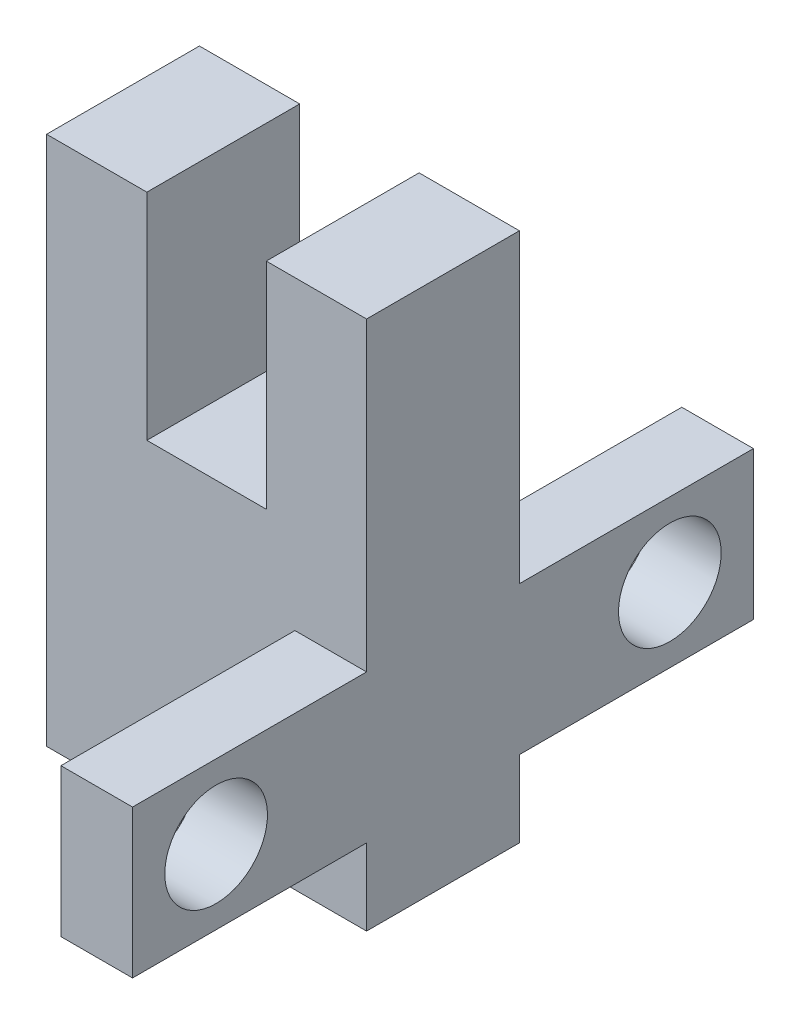
ISO-10303-21;
HEADER;
FILE_DESCRIPTION(('STEP AP214'),'2;1');
FILE_NAME('part.step','',(''),(''),'','','');
FILE_SCHEMA(('AUTOMOTIVE_DESIGN { 1 0 10303 214 1 1 1 1 }'));
ENDSEC;
DATA;
#1=APPLICATION_CONTEXT('core data for automotive mechanical design processes');
#2=APPLICATION_PROTOCOL_DEFINITION('international standard','automotive_design',2000,#1);
#3=PRODUCT_CONTEXT('',#1,'mechanical');
#4=PRODUCT('Part','Part','',(#3));
#5=PRODUCT_RELATED_PRODUCT_CATEGORY('part','',(#4));
#6=PRODUCT_DEFINITION_FORMATION('','',#4);
#7=PRODUCT_DEFINITION_CONTEXT('part definition',#1,'design');
#8=PRODUCT_DEFINITION('design','',#6,#7);
#9=PRODUCT_DEFINITION_SHAPE('','',#8);
#10=(LENGTH_UNIT() NAMED_UNIT(*) SI_UNIT(.MILLI.,.METRE.));
#11=(NAMED_UNIT(*) PLANE_ANGLE_UNIT() SI_UNIT($,.RADIAN.));
#12=(NAMED_UNIT(*) SI_UNIT($,.STERADIAN.) SOLID_ANGLE_UNIT());
#13=UNCERTAINTY_MEASURE_WITH_UNIT(LENGTH_MEASURE(1.E-05),#10,'distance_accuracy_value','');
#14=(GEOMETRIC_REPRESENTATION_CONTEXT(3) GLOBAL_UNCERTAINTY_ASSIGNED_CONTEXT((#13)) GLOBAL_UNIT_ASSIGNED_CONTEXT((#10,
#11,#12)) REPRESENTATION_CONTEXT('',''));
#15=CARTESIAN_POINT('',(0.,0.,0.));
#16=DIRECTION('',(0.,0.,1.));
#17=DIRECTION('',(1.,0.,0.));
#18=AXIS2_PLACEMENT_3D('',#15,#16,#17);
#19=CARTESIAN_POINT('',(0.,0.,0.));
#20=DIRECTION('',(0.,0.,-1.));
#21=DIRECTION('',(-1.,0.,0.));
#22=AXIS2_PLACEMENT_3D('',#19,#20,#21);
#23=PLANE('',#22);
#24=DIRECTION('',(0.,1.,0.));
#25=VECTOR('',#24,1.);
#26=CARTESIAN_POINT('',(13.4,0.,0.));
#27=LINE('',#26,#25);
#28=CARTESIAN_POINT('',(13.4,9.4,0.));
#29=VERTEX_POINT('',#28);
#30=CARTESIAN_POINT('',(13.4,22.2,0.));
#31=VERTEX_POINT('',#30);
#32=EDGE_CURVE('E260',#29,#31,#27,.T.);
#33=ORIENTED_EDGE('',*,*,#32,.F.);
#34=DIRECTION('',(-1.,0.,0.));
#35=VECTOR('',#34,1.);
#36=CARTESIAN_POINT('',(13.4,9.4,0.));
#37=LINE('',#36,#35);
#38=CARTESIAN_POINT('',(10.4,9.4,0.));
#39=VERTEX_POINT('',#38);
#40=EDGE_CURVE('E167',#29,#39,#37,.T.);
#41=ORIENTED_EDGE('',*,*,#40,.T.);
#42=DIRECTION('',(0.,-1.,0.));
#43=VECTOR('',#42,1.);
#44=CARTESIAN_POINT('',(10.4,9.4,0.));
#45=LINE('',#44,#43);
#46=CARTESIAN_POINT('',(10.4,3.2,0.));
#47=VERTEX_POINT('',#46);
#48=EDGE_CURVE('E179',#39,#47,#45,.T.);
#49=ORIENTED_EDGE('',*,*,#48,.T.);
#50=DIRECTION('',(1.,0.,0.));
#51=VECTOR('',#50,1.);
#52=CARTESIAN_POINT('',(13.4,3.2,0.));
#53=LINE('',#52,#51);
#54=CARTESIAN_POINT('',(13.4,3.2,0.));
#55=VERTEX_POINT('',#54);
#56=EDGE_CURVE('E177',#47,#55,#53,.T.);
#57=ORIENTED_EDGE('',*,*,#56,.T.);
#58=CARTESIAN_POINT('',(13.4,0.,0.));
#59=VERTEX_POINT('',#58);
#60=EDGE_CURVE('E155',#59,#55,#27,.T.);
#61=ORIENTED_EDGE('',*,*,#60,.F.);
#62=DIRECTION('',(1.,0.,0.));
#63=VECTOR('',#62,1.);
#64=CARTESIAN_POINT('',(0.,0.,0.));
#65=LINE('',#64,#63);
#66=CARTESIAN_POINT('',(0.,0.,0.));
#67=VERTEX_POINT('',#66);
#68=EDGE_CURVE('E258',#67,#59,#65,.T.);
#69=ORIENTED_EDGE('',*,*,#68,.F.);
#70=DIRECTION('',(0.,-1.,0.));
#71=VECTOR('',#70,1.);
#72=CARTESIAN_POINT('',(0.,0.,0.));
#73=LINE('',#72,#71);
#74=CARTESIAN_POINT('',(0.,22.2,0.));
#75=VERTEX_POINT('',#74);
#76=EDGE_CURVE('E235',#75,#67,#73,.T.);
#77=ORIENTED_EDGE('',*,*,#76,.F.);
#78=DIRECTION('',(-1.,0.,0.));
#79=VECTOR('',#78,1.);
#80=CARTESIAN_POINT('',(0.,22.2,0.));
#81=LINE('',#80,#79);
#82=CARTESIAN_POINT('',(4.2,22.2,0.));
#83=VERTEX_POINT('',#82);
#84=EDGE_CURVE('E262',#83,#75,#81,.T.);
#85=ORIENTED_EDGE('',*,*,#84,.F.);
#86=DIRECTION('',(0.,-1.,0.));
#87=VECTOR('',#86,1.);
#88=CARTESIAN_POINT('',(4.2,22.2,0.));
#89=LINE('',#88,#87);
#90=CARTESIAN_POINT('',(4.2,13.2,0.));
#91=VERTEX_POINT('',#90);
#92=EDGE_CURVE('E216',#83,#91,#89,.T.);
#93=ORIENTED_EDGE('',*,*,#92,.T.);
#94=DIRECTION('',(1.,0.,0.));
#95=VECTOR('',#94,1.);
#96=CARTESIAN_POINT('',(4.2,13.2,0.));
#97=LINE('',#96,#95);
#98=CARTESIAN_POINT('',(9.2,13.2,0.));
#99=VERTEX_POINT('',#98);
#100=EDGE_CURVE('E219',#91,#99,#97,.T.);
#101=ORIENTED_EDGE('',*,*,#100,.T.);
#102=DIRECTION('',(0.,1.,0.));
#103=VECTOR('',#102,1.);
#104=CARTESIAN_POINT('',(9.2,22.2,0.));
#105=LINE('',#104,#103);
#106=CARTESIAN_POINT('',(9.2,22.2,0.));
#107=VERTEX_POINT('',#106);
#108=EDGE_CURVE('E223',#99,#107,#105,.T.);
#109=ORIENTED_EDGE('',*,*,#108,.T.);
#110=EDGE_CURVE('E246',#31,#107,#81,.T.);
#111=ORIENTED_EDGE('',*,*,#110,.F.);
#112=EDGE_LOOP('',(#33,#41,#49,#57,#61,#69,#77,#85,#93,#101,#109,#111));
#113=FACE_BOUND('',#112,.T.);
#114=ADVANCED_FACE('F35',(#113),#23,.T.);
#115=CARTESIAN_POINT('',(0.,0.,6.4));
#116=DIRECTION('',(0.,0.,-1.));
#117=DIRECTION('',(-1.,0.,0.));
#118=AXIS2_PLACEMENT_3D('',#115,#116,#117);
#119=PLANE('',#118);
#120=DIRECTION('',(1.,0.,0.));
#121=VECTOR('',#120,1.);
#122=CARTESIAN_POINT('',(13.4,3.2,6.4));
#123=LINE('',#122,#121);
#124=CARTESIAN_POINT('',(10.4,3.2,6.4));
#125=VERTEX_POINT('',#124);
#126=CARTESIAN_POINT('',(13.4,3.2,6.4));
#127=VERTEX_POINT('',#126);
#128=EDGE_CURVE('E58',#125,#127,#123,.T.);
#129=ORIENTED_EDGE('',*,*,#128,.F.);
#130=DIRECTION('',(0.,-1.,0.));
#131=VECTOR('',#130,1.);
#132=CARTESIAN_POINT('',(10.4,9.4,6.4));
#133=LINE('',#132,#131);
#134=CARTESIAN_POINT('',(10.4,9.4,6.4));
#135=VERTEX_POINT('',#134);
#136=EDGE_CURVE('E201',#135,#125,#133,.T.);
#137=ORIENTED_EDGE('',*,*,#136,.F.);
#138=DIRECTION('',(-1.,0.,0.));
#139=VECTOR('',#138,1.);
#140=CARTESIAN_POINT('',(13.4,9.4,6.4));
#141=LINE('',#140,#139);
#142=CARTESIAN_POINT('',(13.4,9.4,6.4));
#143=VERTEX_POINT('',#142);
#144=EDGE_CURVE('E156',#143,#135,#141,.T.);
#145=ORIENTED_EDGE('',*,*,#144,.F.);
#146=DIRECTION('',(0.,1.,0.));
#147=VECTOR('',#146,1.);
#148=CARTESIAN_POINT('',(13.4,0.,6.4));
#149=LINE('',#148,#147);
#150=CARTESIAN_POINT('',(13.4,22.2,6.4));
#151=VERTEX_POINT('',#150);
#152=EDGE_CURVE('E248',#143,#151,#149,.T.);
#153=ORIENTED_EDGE('',*,*,#152,.T.);
#154=DIRECTION('',(-1.,0.,0.));
#155=VECTOR('',#154,1.);
#156=CARTESIAN_POINT('',(0.,22.2,6.4));
#157=LINE('',#156,#155);
#158=CARTESIAN_POINT('',(9.2,22.2,6.4));
#159=VERTEX_POINT('',#158);
#160=EDGE_CURVE('E252',#151,#159,#157,.T.);
#161=ORIENTED_EDGE('',*,*,#160,.T.);
#162=DIRECTION('',(0.,1.,0.));
#163=VECTOR('',#162,1.);
#164=CARTESIAN_POINT('',(9.2,22.2,6.4));
#165=LINE('',#164,#163);
#166=CARTESIAN_POINT('',(9.2,13.2,6.4));
#167=VERTEX_POINT('',#166);
#168=EDGE_CURVE('E220',#167,#159,#165,.T.);
#169=ORIENTED_EDGE('',*,*,#168,.F.);
#170=DIRECTION('',(1.,0.,0.));
#171=VECTOR('',#170,1.);
#172=CARTESIAN_POINT('',(4.2,13.2,6.4));
#173=LINE('',#172,#171);
#174=CARTESIAN_POINT('',(4.2,13.2,6.4));
#175=VERTEX_POINT('',#174);
#176=EDGE_CURVE('E229',#175,#167,#173,.T.);
#177=ORIENTED_EDGE('',*,*,#176,.F.);
#178=DIRECTION('',(0.,-1.,0.));
#179=VECTOR('',#178,1.);
#180=CARTESIAN_POINT('',(4.2,22.2,6.4));
#181=LINE('',#180,#179);
#182=CARTESIAN_POINT('',(4.2,22.2,6.4));
#183=VERTEX_POINT('',#182);
#184=EDGE_CURVE('E215',#183,#175,#181,.T.);
#185=ORIENTED_EDGE('',*,*,#184,.F.);
#186=CARTESIAN_POINT('',(0.,22.2,6.4));
#187=VERTEX_POINT('',#186);
#188=EDGE_CURVE('E251',#183,#187,#157,.T.);
#189=ORIENTED_EDGE('',*,*,#188,.T.);
#190=DIRECTION('',(0.,-1.,0.));
#191=VECTOR('',#190,1.);
#192=CARTESIAN_POINT('',(0.,0.,6.4));
#193=LINE('',#192,#191);
#194=CARTESIAN_POINT('',(0.,0.,6.4));
#195=VERTEX_POINT('',#194);
#196=EDGE_CURVE('E242',#187,#195,#193,.T.);
#197=ORIENTED_EDGE('',*,*,#196,.T.);
#198=DIRECTION('',(1.,0.,0.));
#199=VECTOR('',#198,1.);
#200=CARTESIAN_POINT('',(0.,0.,6.4));
#201=LINE('',#200,#199);
#202=CARTESIAN_POINT('',(13.4,0.,6.4));
#203=VERTEX_POINT('',#202);
#204=EDGE_CURVE('E245',#195,#203,#201,.T.);
#205=ORIENTED_EDGE('',*,*,#204,.T.);
#206=EDGE_CURVE('E249',#203,#127,#149,.T.);
#207=ORIENTED_EDGE('',*,*,#206,.T.);
#208=EDGE_LOOP('',(#129,#137,#145,#153,#161,#169,#177,#185,#189,#197,#205,#207));
#209=FACE_BOUND('',#208,.T.);
#210=ADVANCED_FACE('F296',(#209),#119,.F.);
#211=CARTESIAN_POINT('',(0.,22.2,6.4));
#212=DIRECTION('',(0.,-1.,0.));
#213=DIRECTION('',(0.,0.,-1.));
#214=AXIS2_PLACEMENT_3D('',#211,#212,#213);
#215=PLANE('',#214);
#216=ORIENTED_EDGE('',*,*,#188,.F.);
#217=DIRECTION('',(0.,0.,1.));
#218=VECTOR('',#217,1.);
#219=CARTESIAN_POINT('',(4.2,22.2,0.));
#220=LINE('',#219,#218);
#221=EDGE_CURVE('E233',#83,#183,#220,.T.);
#222=ORIENTED_EDGE('',*,*,#221,.F.);
#223=ORIENTED_EDGE('',*,*,#84,.T.);
#224=DIRECTION('',(0.,0.,-1.));
#225=VECTOR('',#224,1.);
#226=CARTESIAN_POINT('',(0.,22.2,6.4));
#227=LINE('',#226,#225);
#228=EDGE_CURVE('E255',#187,#75,#227,.T.);
#229=ORIENTED_EDGE('',*,*,#228,.F.);
#230=EDGE_LOOP('',(#216,#222,#223,#229));
#231=FACE_BOUND('',#230,.T.);
#232=ADVANCED_FACE('F327',(#231),#215,.F.);
#233=CARTESIAN_POINT('',(0.,0.,6.4));
#234=DIRECTION('',(1.,0.,0.));
#235=DIRECTION('',(0.,0.,-1.));
#236=AXIS2_PLACEMENT_3D('',#233,#234,#235);
#237=PLANE('',#236);
#238=ORIENTED_EDGE('',*,*,#76,.T.);
#239=DIRECTION('',(0.,0.,-1.));
#240=VECTOR('',#239,1.);
#241=CARTESIAN_POINT('',(0.,0.,6.4));
#242=LINE('',#241,#240);
#243=EDGE_CURVE('E11',#195,#67,#242,.T.);
#244=ORIENTED_EDGE('',*,*,#243,.F.);
#245=ORIENTED_EDGE('',*,*,#196,.F.);
#246=ORIENTED_EDGE('',*,*,#228,.T.);
#247=EDGE_LOOP('',(#238,#244,#245,#246));
#248=FACE_BOUND('',#247,.T.);
#249=ADVANCED_FACE('F37',(#248),#237,.F.);
#250=CARTESIAN_POINT('',(0.,0.,6.4));
#251=DIRECTION('',(0.,1.,0.));
#252=DIRECTION('',(0.,0.,1.));
#253=AXIS2_PLACEMENT_3D('',#250,#251,#252);
#254=PLANE('',#253);
#255=ORIENTED_EDGE('',*,*,#68,.T.);
#256=DIRECTION('',(0.,0.,-1.));
#257=VECTOR('',#256,1.);
#258=CARTESIAN_POINT('',(13.4,0.,6.4));
#259=LINE('',#258,#257);
#260=EDGE_CURVE('E43',#203,#59,#259,.T.);
#261=ORIENTED_EDGE('',*,*,#260,.F.);
#262=ORIENTED_EDGE('',*,*,#204,.F.);
#263=ORIENTED_EDGE('',*,*,#243,.T.);
#264=EDGE_LOOP('',(#255,#261,#262,#263));
#265=FACE_BOUND('',#264,.T.);
#266=ADVANCED_FACE('F335',(#265),#254,.F.);
#267=CARTESIAN_POINT('',(13.4,0.,6.4));
#268=DIRECTION('',(-1.,0.,0.));
#269=DIRECTION('',(0.,-1.,0.));
#270=AXIS2_PLACEMENT_3D('',#267,#268,#269);
#271=PLANE('',#270);
#272=CARTESIAN_POINT('',(13.4,6.3,12.7));
#273=DIRECTION('',(-1.,0.,0.));
#274=DIRECTION('',(0.,-1.,0.));
#275=AXIS2_PLACEMENT_3D('',#272,#273,#274);
#276=CIRCLE('',#275,2.15);
#277=CARTESIAN_POINT('',(13.4,4.15,12.7));
#278=VERTEX_POINT('',#277);
#279=EDGE_CURVE('E459',#278,#278,#276,.T.);
#280=ORIENTED_EDGE('',*,*,#279,.T.);
#281=EDGE_LOOP('',(#280));
#282=FACE_BOUND('',#281,.T.);
#283=CARTESIAN_POINT('',(13.4,6.3,-6.3));
#284=DIRECTION('',(-1.,0.,0.));
#285=DIRECTION('',(0.,-1.,0.));
#286=AXIS2_PLACEMENT_3D('',#283,#284,#285);
#287=CIRCLE('',#286,2.15);
#288=CARTESIAN_POINT('',(13.4,4.15,-6.3));
#289=VERTEX_POINT('',#288);
#290=EDGE_CURVE('E180',#289,#289,#287,.T.);
#291=ORIENTED_EDGE('',*,*,#290,.T.);
#292=EDGE_LOOP('',(#291));
#293=FACE_BOUND('',#292,.T.);
#294=ORIENTED_EDGE('',*,*,#60,.T.);
#295=DIRECTION('',(0.,0.,1.));
#296=VECTOR('',#295,1.);
#297=CARTESIAN_POINT('',(13.4,3.2,-9.8));
#298=LINE('',#297,#296);
#299=CARTESIAN_POINT('',(13.4,3.2,-9.8));
#300=VERTEX_POINT('',#299);
#301=EDGE_CURVE('E50',#300,#55,#298,.T.);
#302=ORIENTED_EDGE('',*,*,#301,.F.);
#303=DIRECTION('',(0.,1.,0.));
#304=VECTOR('',#303,1.);
#305=CARTESIAN_POINT('',(13.4,9.4,-9.8));
#306=LINE('',#305,#304);
#307=CARTESIAN_POINT('',(13.4,9.4,-9.8));
#308=VERTEX_POINT('',#307);
#309=EDGE_CURVE('E151',#300,#308,#306,.T.);
#310=ORIENTED_EDGE('',*,*,#309,.T.);
#311=DIRECTION('',(0.,0.,1.));
#312=VECTOR('',#311,1.);
#313=CARTESIAN_POINT('',(13.4,9.4,-9.8));
#314=LINE('',#313,#312);
#315=EDGE_CURVE('E176',#308,#29,#314,.T.);
#316=ORIENTED_EDGE('',*,*,#315,.T.);
#317=ORIENTED_EDGE('',*,*,#32,.T.);
#318=DIRECTION('',(0.,0.,-1.));
#319=VECTOR('',#318,1.);
#320=CARTESIAN_POINT('',(13.4,22.2,6.4));
#321=LINE('',#320,#319);
#322=EDGE_CURVE('E267',#151,#31,#321,.T.);
#323=ORIENTED_EDGE('',*,*,#322,.F.);
#324=ORIENTED_EDGE('',*,*,#152,.F.);
#325=DIRECTION('',(0.,0.,-1.));
#326=VECTOR('',#325,1.);
#327=CARTESIAN_POINT('',(13.4,9.4,16.2));
#328=LINE('',#327,#326);
#329=CARTESIAN_POINT('',(13.4,9.4,16.2));
#330=VERTEX_POINT('',#329);
#331=EDGE_CURVE('E212',#330,#143,#328,.T.);
#332=ORIENTED_EDGE('',*,*,#331,.F.);
#333=DIRECTION('',(0.,1.,0.));
#334=VECTOR('',#333,1.);
#335=CARTESIAN_POINT('',(13.4,9.4,16.2));
#336=LINE('',#335,#334);
#337=CARTESIAN_POINT('',(13.4,3.2,16.2));
#338=VERTEX_POINT('',#337);
#339=EDGE_CURVE('E189',#338,#330,#336,.T.);
#340=ORIENTED_EDGE('',*,*,#339,.F.);
#341=DIRECTION('',(0.,0.,-1.));
#342=VECTOR('',#341,1.);
#343=CARTESIAN_POINT('',(13.4,3.2,16.2));
#344=LINE('',#343,#342);
#345=EDGE_CURVE('E198',#338,#127,#344,.T.);
#346=ORIENTED_EDGE('',*,*,#345,.T.);
#347=ORIENTED_EDGE('',*,*,#206,.F.);
#348=ORIENTED_EDGE('',*,*,#260,.T.);
#349=EDGE_LOOP('',(#294,#302,#310,#316,#317,#323,#324,#332,#340,#346,#347,#348));
#350=FACE_BOUND('',#349,.T.);
#351=ADVANCED_FACE('F150',(#282,#293,#350),#271,.F.);
#352=ORIENTED_EDGE('',*,*,#110,.T.);
#353=DIRECTION('',(0.,0.,1.));
#354=VECTOR('',#353,1.);
#355=CARTESIAN_POINT('',(9.2,22.2,0.));
#356=LINE('',#355,#354);
#357=EDGE_CURVE('E236',#107,#159,#356,.T.);
#358=ORIENTED_EDGE('',*,*,#357,.T.);
#359=ORIENTED_EDGE('',*,*,#160,.F.);
#360=ORIENTED_EDGE('',*,*,#322,.T.);
#361=EDGE_LOOP('',(#352,#358,#359,#360));
#362=FACE_BOUND('',#361,.T.);
#363=ADVANCED_FACE('F286',(#362),#215,.F.);
#364=CARTESIAN_POINT('',(4.2,22.2,0.));
#365=DIRECTION('',(-1.,0.,0.));
#366=DIRECTION('',(0.,-1.,0.));
#367=AXIS2_PLACEMENT_3D('',#364,#365,#366);
#368=PLANE('',#367);
#369=ORIENTED_EDGE('',*,*,#184,.T.);
#370=DIRECTION('',(0.,0.,1.));
#371=VECTOR('',#370,1.);
#372=CARTESIAN_POINT('',(4.2,13.2,0.));
#373=LINE('',#372,#371);
#374=EDGE_CURVE('E226',#91,#175,#373,.T.);
#375=ORIENTED_EDGE('',*,*,#374,.F.);
#376=ORIENTED_EDGE('',*,*,#92,.F.);
#377=ORIENTED_EDGE('',*,*,#221,.T.);
#378=EDGE_LOOP('',(#369,#375,#376,#377));
#379=FACE_BOUND('',#378,.T.);
#380=ADVANCED_FACE('F333',(#379),#368,.F.);
#381=CARTESIAN_POINT('',(9.2,22.2,0.));
#382=DIRECTION('',(1.,0.,0.));
#383=DIRECTION('',(0.,1.,0.));
#384=AXIS2_PLACEMENT_3D('',#381,#382,#383);
#385=PLANE('',#384);
#386=ORIENTED_EDGE('',*,*,#168,.T.);
#387=ORIENTED_EDGE('',*,*,#357,.F.);
#388=ORIENTED_EDGE('',*,*,#108,.F.);
#389=DIRECTION('',(0.,0.,1.));
#390=VECTOR('',#389,1.);
#391=CARTESIAN_POINT('',(9.2,13.2,0.));
#392=LINE('',#391,#390);
#393=EDGE_CURVE('E239',#99,#167,#392,.T.);
#394=ORIENTED_EDGE('',*,*,#393,.T.);
#395=EDGE_LOOP('',(#386,#387,#388,#394));
#396=FACE_BOUND('',#395,.T.);
#397=ADVANCED_FACE('F290',(#396),#385,.F.);
#398=CARTESIAN_POINT('',(4.2,13.2,0.));
#399=DIRECTION('',(0.,-1.,0.));
#400=DIRECTION('',(0.,0.,-1.));
#401=AXIS2_PLACEMENT_3D('',#398,#399,#400);
#402=PLANE('',#401);
#403=ORIENTED_EDGE('',*,*,#176,.T.);
#404=ORIENTED_EDGE('',*,*,#393,.F.);
#405=ORIENTED_EDGE('',*,*,#100,.F.);
#406=ORIENTED_EDGE('',*,*,#374,.T.);
#407=EDGE_LOOP('',(#403,#404,#405,#406));
#408=FACE_BOUND('',#407,.T.);
#409=ADVANCED_FACE('F292',(#408),#402,.F.);
#410=CARTESIAN_POINT('',(13.4,9.4,16.2));
#411=DIRECTION('',(0.,-1.,0.));
#412=DIRECTION('',(1.,0.,0.));
#413=AXIS2_PLACEMENT_3D('',#410,#411,#412);
#414=PLANE('',#413);
#415=ORIENTED_EDGE('',*,*,#144,.T.);
#416=DIRECTION('',(0.,0.,-1.));
#417=VECTOR('',#416,1.);
#418=CARTESIAN_POINT('',(10.4,9.4,16.2));
#419=LINE('',#418,#417);
#420=CARTESIAN_POINT('',(10.4,9.4,16.2));
#421=VERTEX_POINT('',#420);
#422=EDGE_CURVE('E209',#421,#135,#419,.T.);
#423=ORIENTED_EDGE('',*,*,#422,.F.);
#424=DIRECTION('',(-1.,0.,0.));
#425=VECTOR('',#424,1.);
#426=CARTESIAN_POINT('',(13.4,9.4,16.2));
#427=LINE('',#426,#425);
#428=EDGE_CURVE('E192',#330,#421,#427,.T.);
#429=ORIENTED_EDGE('',*,*,#428,.F.);
#430=ORIENTED_EDGE('',*,*,#331,.T.);
#431=EDGE_LOOP('',(#415,#423,#429,#430));
#432=FACE_BOUND('',#431,.T.);
#433=ADVANCED_FACE('F300',(#432),#414,.F.);
#434=CARTESIAN_POINT('',(10.4,9.4,16.2));
#435=DIRECTION('',(1.,0.,0.));
#436=DIRECTION('',(0.,0.,-1.));
#437=AXIS2_PLACEMENT_3D('',#434,#435,#436);
#438=PLANE('',#437);
#439=CARTESIAN_POINT('',(10.4,6.3,12.7));
#440=DIRECTION('',(-1.,0.,0.));
#441=DIRECTION('',(0.,0.,-1.));
#442=AXIS2_PLACEMENT_3D('',#439,#440,#441);
#443=CIRCLE('',#442,2.15);
#444=CARTESIAN_POINT('',(10.4,6.3,10.55));
#445=VERTEX_POINT('',#444);
#446=EDGE_CURVE('E456',#445,#445,#443,.T.);
#447=ORIENTED_EDGE('',*,*,#446,.F.);
#448=EDGE_LOOP('',(#447));
#449=FACE_BOUND('',#448,.T.);
#450=ORIENTED_EDGE('',*,*,#136,.T.);
#451=DIRECTION('',(0.,0.,-1.));
#452=VECTOR('',#451,1.);
#453=CARTESIAN_POINT('',(10.4,3.2,16.2));
#454=LINE('',#453,#452);
#455=CARTESIAN_POINT('',(10.4,3.2,16.2));
#456=VERTEX_POINT('',#455);
#457=EDGE_CURVE('E206',#456,#125,#454,.T.);
#458=ORIENTED_EDGE('',*,*,#457,.F.);
#459=DIRECTION('',(0.,-1.,0.));
#460=VECTOR('',#459,1.);
#461=CARTESIAN_POINT('',(10.4,9.4,16.2));
#462=LINE('',#461,#460);
#463=EDGE_CURVE('E194',#421,#456,#462,.T.);
#464=ORIENTED_EDGE('',*,*,#463,.F.);
#465=ORIENTED_EDGE('',*,*,#422,.T.);
#466=EDGE_LOOP('',(#450,#458,#464,#465));
#467=FACE_BOUND('',#466,.T.);
#468=ADVANCED_FACE('F311',(#449,#467),#438,.F.);
#469=CARTESIAN_POINT('',(13.4,3.2,16.2));
#470=DIRECTION('',(0.,1.,0.));
#471=DIRECTION('',(-1.,0.,0.));
#472=AXIS2_PLACEMENT_3D('',#469,#470,#471);
#473=PLANE('',#472);
#474=ORIENTED_EDGE('',*,*,#128,.T.);
#475=ORIENTED_EDGE('',*,*,#345,.F.);
#476=DIRECTION('',(1.,0.,0.));
#477=VECTOR('',#476,1.);
#478=CARTESIAN_POINT('',(13.4,3.2,16.2));
#479=LINE('',#478,#477);
#480=EDGE_CURVE('E196',#456,#338,#479,.T.);
#481=ORIENTED_EDGE('',*,*,#480,.F.);
#482=ORIENTED_EDGE('',*,*,#457,.T.);
#483=EDGE_LOOP('',(#474,#475,#481,#482));
#484=FACE_BOUND('',#483,.T.);
#485=ADVANCED_FACE('F308',(#484),#473,.F.);
#486=CARTESIAN_POINT('',(0.,0.,16.2));
#487=DIRECTION('',(0.,0.,-1.));
#488=DIRECTION('',(-1.,0.,0.));
#489=AXIS2_PLACEMENT_3D('',#486,#487,#488);
#490=PLANE('',#489);
#491=ORIENTED_EDGE('',*,*,#339,.T.);
#492=ORIENTED_EDGE('',*,*,#428,.T.);
#493=ORIENTED_EDGE('',*,*,#463,.T.);
#494=ORIENTED_EDGE('',*,*,#480,.T.);
#495=EDGE_LOOP('',(#491,#492,#493,#494));
#496=FACE_BOUND('',#495,.T.);
#497=ADVANCED_FACE('F304',(#496),#490,.F.);
#498=CARTESIAN_POINT('',(13.4,3.2,-9.8));
#499=DIRECTION('',(0.,-1.,0.));
#500=DIRECTION('',(1.,0.,0.));
#501=AXIS2_PLACEMENT_3D('',#498,#499,#500);
#502=PLANE('',#501);
#503=ORIENTED_EDGE('',*,*,#56,.F.);
#504=DIRECTION('',(0.,0.,1.));
#505=VECTOR('',#504,1.);
#506=CARTESIAN_POINT('',(10.4,3.2,-9.8));
#507=LINE('',#506,#505);
#508=CARTESIAN_POINT('',(10.4,3.2,-9.8));
#509=VERTEX_POINT('',#508);
#510=EDGE_CURVE('E157',#509,#47,#507,.T.);
#511=ORIENTED_EDGE('',*,*,#510,.F.);
#512=DIRECTION('',(1.,0.,0.));
#513=VECTOR('',#512,1.);
#514=CARTESIAN_POINT('',(13.4,3.2,-9.8));
#515=LINE('',#514,#513);
#516=EDGE_CURVE('E163',#509,#300,#515,.T.);
#517=ORIENTED_EDGE('',*,*,#516,.T.);
#518=ORIENTED_EDGE('',*,*,#301,.T.);
#519=EDGE_LOOP('',(#503,#511,#517,#518));
#520=FACE_BOUND('',#519,.T.);
#521=ADVANCED_FACE('F169',(#520),#502,.T.);
#522=CARTESIAN_POINT('',(10.4,9.4,-9.8));
#523=DIRECTION('',(-1.,0.,0.));
#524=DIRECTION('',(0.,0.,1.));
#525=AXIS2_PLACEMENT_3D('',#522,#523,#524);
#526=PLANE('',#525);
#527=CARTESIAN_POINT('',(10.4,6.3,-6.3));
#528=DIRECTION('',(-1.,0.,0.));
#529=DIRECTION('',(0.,0.,1.));
#530=AXIS2_PLACEMENT_3D('',#527,#528,#529);
#531=CIRCLE('',#530,2.15);
#532=CARTESIAN_POINT('',(10.4,6.3,-4.15));
#533=VERTEX_POINT('',#532);
#534=EDGE_CURVE('E460',#533,#533,#531,.T.);
#535=ORIENTED_EDGE('',*,*,#534,.F.);
#536=EDGE_LOOP('',(#535));
#537=FACE_BOUND('',#536,.T.);
#538=ORIENTED_EDGE('',*,*,#48,.F.);
#539=DIRECTION('',(0.,0.,1.));
#540=VECTOR('',#539,1.);
#541=CARTESIAN_POINT('',(10.4,9.4,-9.8));
#542=LINE('',#541,#540);
#543=CARTESIAN_POINT('',(10.4,9.4,-9.8));
#544=VERTEX_POINT('',#543);
#545=EDGE_CURVE('E186',#544,#39,#542,.T.);
#546=ORIENTED_EDGE('',*,*,#545,.F.);
#547=DIRECTION('',(0.,-1.,0.));
#548=VECTOR('',#547,1.);
#549=CARTESIAN_POINT('',(10.4,9.4,-9.8));
#550=LINE('',#549,#548);
#551=EDGE_CURVE('E170',#544,#509,#550,.T.);
#552=ORIENTED_EDGE('',*,*,#551,.T.);
#553=ORIENTED_EDGE('',*,*,#510,.T.);
#554=EDGE_LOOP('',(#538,#546,#552,#553));
#555=FACE_BOUND('',#554,.T.);
#556=ADVANCED_FACE('F278',(#537,#555),#526,.T.);
#557=CARTESIAN_POINT('',(13.4,9.4,-9.8));
#558=DIRECTION('',(0.,1.,0.));
#559=DIRECTION('',(-1.,0.,0.));
#560=AXIS2_PLACEMENT_3D('',#557,#558,#559);
#561=PLANE('',#560);
#562=ORIENTED_EDGE('',*,*,#40,.F.);
#563=ORIENTED_EDGE('',*,*,#315,.F.);
#564=DIRECTION('',(-1.,0.,0.));
#565=VECTOR('',#564,1.);
#566=CARTESIAN_POINT('',(13.4,9.4,-9.8));
#567=LINE('',#566,#565);
#568=EDGE_CURVE('E166',#308,#544,#567,.T.);
#569=ORIENTED_EDGE('',*,*,#568,.T.);
#570=ORIENTED_EDGE('',*,*,#545,.T.);
#571=EDGE_LOOP('',(#562,#563,#569,#570));
#572=FACE_BOUND('',#571,.T.);
#573=ADVANCED_FACE('F280',(#572),#561,.T.);
#574=CARTESIAN_POINT('',(0.,0.,-9.8));
#575=DIRECTION('',(0.,0.,1.));
#576=DIRECTION('',(-1.,0.,0.));
#577=AXIS2_PLACEMENT_3D('',#574,#575,#576);
#578=PLANE('',#577);
#579=ORIENTED_EDGE('',*,*,#309,.F.);
#580=ORIENTED_EDGE('',*,*,#516,.F.);
#581=ORIENTED_EDGE('',*,*,#551,.F.);
#582=ORIENTED_EDGE('',*,*,#568,.F.);
#583=EDGE_LOOP('',(#579,#580,#581,#582));
#584=FACE_BOUND('',#583,.T.);
#585=ADVANCED_FACE('F161',(#584),#578,.F.);
#586=CARTESIAN_POINT('',(20.2,6.3,-6.3));
#587=DIRECTION('',(-1.,0.,0.));
#588=DIRECTION('',(0.,0.,1.));
#589=AXIS2_PLACEMENT_3D('',#586,#587,#588);
#590=CYLINDRICAL_SURFACE('',#589,2.15);
#591=ORIENTED_EDGE('',*,*,#534,.T.);
#592=EDGE_LOOP('',(#591));
#593=FACE_BOUND('',#592,.T.);
#594=ORIENTED_EDGE('',*,*,#290,.F.);
#595=EDGE_LOOP('',(#594));
#596=FACE_BOUND('',#595,.T.);
#597=ADVANCED_FACE('F416',(#593,#596),#590,.F.);
#598=CARTESIAN_POINT('',(20.2,6.3,12.7));
#599=DIRECTION('',(-1.,0.,0.));
#600=DIRECTION('',(0.,0.,1.));
#601=AXIS2_PLACEMENT_3D('',#598,#599,#600);
#602=CYLINDRICAL_SURFACE('',#601,2.15);
#603=ORIENTED_EDGE('',*,*,#446,.T.);
#604=EDGE_LOOP('',(#603));
#605=FACE_BOUND('',#604,.T.);
#606=ORIENTED_EDGE('',*,*,#279,.F.);
#607=EDGE_LOOP('',(#606));
#608=FACE_BOUND('',#607,.T.);
#609=ADVANCED_FACE('F440',(#605,#608),#602,.F.);
#610=CLOSED_SHELL('',(#114,#210,#232,#249,#266,#351,#363,#380,#397,#409,#433,#468,#485,#497,
#521,#556,#573,#585,#597,#609));
#611=MANIFOLD_SOLID_BREP('B2',#610);
#612=ADVANCED_BREP_SHAPE_REPRESENTATION('',(#18,#611),#14);
#613=SHAPE_DEFINITION_REPRESENTATION(#9,#612);
ENDSEC;
END-ISO-10303-21;
